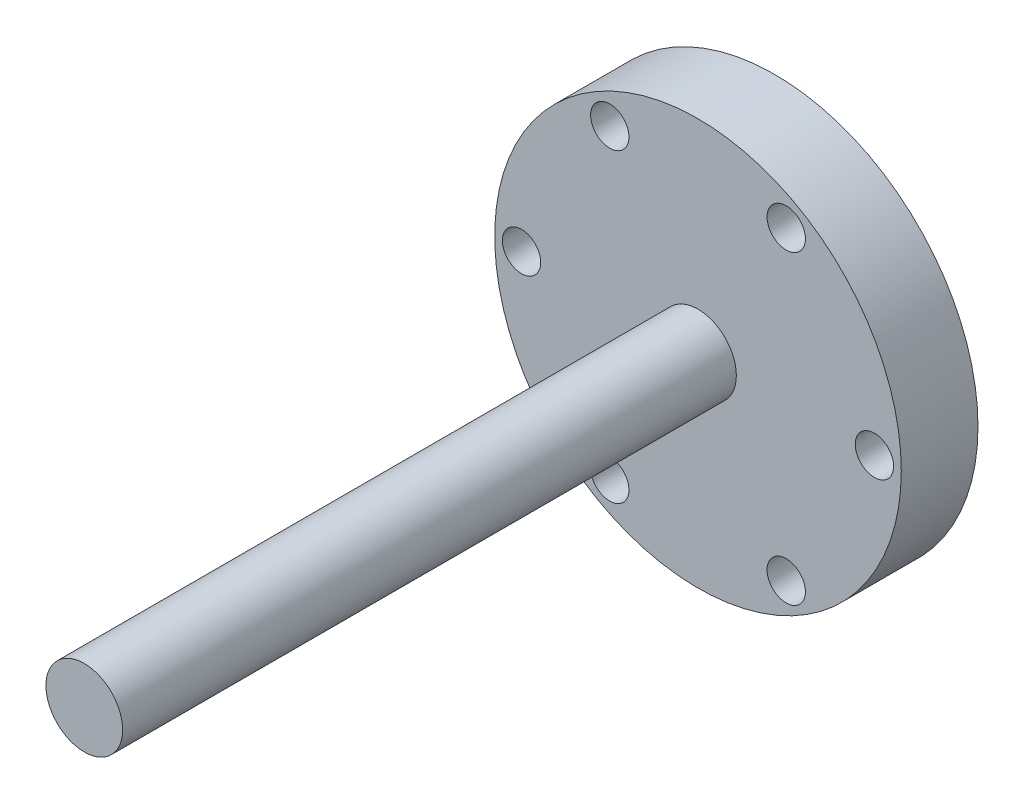
ISO-10303-21;
HEADER;
FILE_DESCRIPTION(('STEP AP214'),'2;1');
FILE_NAME('part.step','',(''),(''),'','','');
FILE_SCHEMA(('AUTOMOTIVE_DESIGN { 1 0 10303 214 1 1 1 1 }'));
ENDSEC;
DATA;
#1=APPLICATION_CONTEXT('core data for automotive mechanical design processes');
#2=APPLICATION_PROTOCOL_DEFINITION('international standard','automotive_design',2000,#1);
#3=PRODUCT_CONTEXT('',#1,'mechanical');
#4=PRODUCT('Part','Part','',(#3));
#5=PRODUCT_RELATED_PRODUCT_CATEGORY('part','',(#4));
#6=PRODUCT_DEFINITION_FORMATION('','',#4);
#7=PRODUCT_DEFINITION_CONTEXT('part definition',#1,'design');
#8=PRODUCT_DEFINITION('design','',#6,#7);
#9=PRODUCT_DEFINITION_SHAPE('','',#8);
#10=(LENGTH_UNIT() NAMED_UNIT(*) SI_UNIT(.MILLI.,.METRE.));
#11=(NAMED_UNIT(*) PLANE_ANGLE_UNIT() SI_UNIT($,.RADIAN.));
#12=(NAMED_UNIT(*) SI_UNIT($,.STERADIAN.) SOLID_ANGLE_UNIT());
#13=UNCERTAINTY_MEASURE_WITH_UNIT(LENGTH_MEASURE(1.E-05),#10,'distance_accuracy_value','');
#14=(GEOMETRIC_REPRESENTATION_CONTEXT(3) GLOBAL_UNCERTAINTY_ASSIGNED_CONTEXT((#13)) GLOBAL_UNIT_ASSIGNED_CONTEXT((#10,
#11,#12)) REPRESENTATION_CONTEXT('',''));
#15=CARTESIAN_POINT('',(0.,0.,0.));
#16=DIRECTION('',(0.,0.,1.));
#17=DIRECTION('',(1.,0.,0.));
#18=AXIS2_PLACEMENT_3D('',#15,#16,#17);
#19=CARTESIAN_POINT('',(0.,0.,10.));
#20=DIRECTION('',(0.,0.,1.));
#21=DIRECTION('',(1.,0.,0.));
#22=AXIS2_PLACEMENT_3D('',#19,#20,#21);
#23=PLANE('',#22);
#24=CARTESIAN_POINT('',(0.,0.,10.));
#25=DIRECTION('',(0.,0.,1.));
#26=DIRECTION('',(1.,0.,0.));
#27=AXIS2_PLACEMENT_3D('',#24,#25,#26);
#28=CIRCLE('',#27,5.);
#29=CARTESIAN_POINT('',(5.,0.,10.));
#30=VERTEX_POINT('',#29);
#31=EDGE_CURVE('E80',#30,#30,#28,.T.);
#32=ORIENTED_EDGE('',*,*,#31,.F.);
#33=EDGE_LOOP('',(#32));
#34=FACE_BOUND('',#33,.T.);
#35=CARTESIAN_POINT('',(-11.5000000000001,-19.918584287042,10.));
#36=DIRECTION('',(0.,0.,1.));
#37=DIRECTION('',(1.,0.,0.));
#38=AXIS2_PLACEMENT_3D('',#35,#36,#37);
#39=CIRCLE('',#38,2.5);
#40=CARTESIAN_POINT('',(-9.00000000000009,-19.918584287042,10.));
#41=VERTEX_POINT('',#40);
#42=EDGE_CURVE('E65',#41,#41,#39,.T.);
#43=ORIENTED_EDGE('',*,*,#42,.F.);
#44=EDGE_LOOP('',(#43));
#45=FACE_BOUND('',#44,.T.);
#46=CARTESIAN_POINT('',(-11.5000000000001,19.918584287042,10.));
#47=DIRECTION('',(0.,0.,1.));
#48=DIRECTION('',(1.,0.,0.));
#49=AXIS2_PLACEMENT_3D('',#46,#47,#48);
#50=CIRCLE('',#49,2.5);
#51=CARTESIAN_POINT('',(-9.0000000000001,19.918584287042,10.));
#52=VERTEX_POINT('',#51);
#53=EDGE_CURVE('E53',#52,#52,#50,.T.);
#54=ORIENTED_EDGE('',*,*,#53,.F.);
#55=EDGE_LOOP('',(#54));
#56=FACE_BOUND('',#55,.T.);
#57=CARTESIAN_POINT('',(23.,0.,10.));
#58=DIRECTION('',(0.,0.,1.));
#59=DIRECTION('',(1.,0.,0.));
#60=AXIS2_PLACEMENT_3D('',#57,#58,#59);
#61=CIRCLE('',#60,2.5);
#62=CARTESIAN_POINT('',(25.5,0.,10.));
#63=VERTEX_POINT('',#62);
#64=EDGE_CURVE('E42',#63,#63,#61,.T.);
#65=ORIENTED_EDGE('',*,*,#64,.F.);
#66=EDGE_LOOP('',(#65));
#67=FACE_BOUND('',#66,.T.);
#68=CARTESIAN_POINT('',(0.,0.,10.));
#69=DIRECTION('',(0.,0.,1.));
#70=DIRECTION('',(1.,0.,0.));
#71=AXIS2_PLACEMENT_3D('',#68,#69,#70);
#72=CIRCLE('',#71,26.5);
#73=CARTESIAN_POINT('',(26.5,0.,10.));
#74=VERTEX_POINT('',#73);
#75=EDGE_CURVE('E10',#74,#74,#72,.T.);
#76=ORIENTED_EDGE('',*,*,#75,.T.);
#77=EDGE_LOOP('',(#76));
#78=FACE_BOUND('',#77,.T.);
#79=CARTESIAN_POINT('',(11.5,19.9185842870421,10.));
#80=DIRECTION('',(0.,0.,1.));
#81=DIRECTION('',(1.,0.,0.));
#82=AXIS2_PLACEMENT_3D('',#79,#80,#81);
#83=CIRCLE('',#82,2.5);
#84=CARTESIAN_POINT('',(14.,19.9185842870421,10.));
#85=VERTEX_POINT('',#84);
#86=EDGE_CURVE('E47',#85,#85,#83,.T.);
#87=ORIENTED_EDGE('',*,*,#86,.F.);
#88=EDGE_LOOP('',(#87));
#89=FACE_BOUND('',#88,.T.);
#90=CARTESIAN_POINT('',(-23.,1.60608141586784E-13,10.));
#91=DIRECTION('',(0.,0.,1.));
#92=DIRECTION('',(1.,0.,0.));
#93=AXIS2_PLACEMENT_3D('',#90,#91,#92);
#94=CIRCLE('',#93,2.5);
#95=CARTESIAN_POINT('',(-20.5,1.60608141586784E-13,10.));
#96=VERTEX_POINT('',#95);
#97=EDGE_CURVE('E59',#96,#96,#94,.T.);
#98=ORIENTED_EDGE('',*,*,#97,.F.);
#99=EDGE_LOOP('',(#98));
#100=FACE_BOUND('',#99,.T.);
#101=CARTESIAN_POINT('',(11.5,-19.9185842870421,10.));
#102=DIRECTION('',(0.,0.,1.));
#103=DIRECTION('',(1.,0.,0.));
#104=AXIS2_PLACEMENT_3D('',#101,#102,#103);
#105=CIRCLE('',#104,2.5);
#106=CARTESIAN_POINT('',(14.,-19.9185842870421,10.));
#107=VERTEX_POINT('',#106);
#108=EDGE_CURVE('E71',#107,#107,#105,.T.);
#109=ORIENTED_EDGE('',*,*,#108,.F.);
#110=EDGE_LOOP('',(#109));
#111=FACE_BOUND('',#110,.T.);
#112=ADVANCED_FACE('F31',(#34,#45,#56,#67,#78,#89,#100,#111),#23,.T.);
#113=CARTESIAN_POINT('',(0.,0.,0.));
#114=DIRECTION('',(0.,0.,1.));
#115=DIRECTION('',(1.,0.,0.));
#116=AXIS2_PLACEMENT_3D('',#113,#114,#115);
#117=PLANE('',#116);
#118=CARTESIAN_POINT('',(0.,0.,0.));
#119=DIRECTION('',(0.,0.,1.));
#120=DIRECTION('',(1.,0.,0.));
#121=AXIS2_PLACEMENT_3D('',#118,#119,#120);
#122=CIRCLE('',#121,26.5);
#123=CARTESIAN_POINT('',(26.5,0.,0.));
#124=VERTEX_POINT('',#123);
#125=EDGE_CURVE('E35',#124,#124,#122,.T.);
#126=ORIENTED_EDGE('',*,*,#125,.F.);
#127=EDGE_LOOP('',(#126));
#128=FACE_BOUND('',#127,.T.);
#129=CARTESIAN_POINT('',(23.,0.,0.));
#130=DIRECTION('',(0.,0.,1.));
#131=DIRECTION('',(1.,0.,0.));
#132=AXIS2_PLACEMENT_3D('',#129,#130,#131);
#133=CIRCLE('',#132,2.5);
#134=CARTESIAN_POINT('',(25.5,0.,0.));
#135=VERTEX_POINT('',#134);
#136=EDGE_CURVE('E44',#135,#135,#133,.T.);
#137=ORIENTED_EDGE('',*,*,#136,.T.);
#138=EDGE_LOOP('',(#137));
#139=FACE_BOUND('',#138,.T.);
#140=CARTESIAN_POINT('',(11.5,19.9185842870421,0.));
#141=DIRECTION('',(0.,0.,1.));
#142=DIRECTION('',(1.,0.,0.));
#143=AXIS2_PLACEMENT_3D('',#140,#141,#142);
#144=CIRCLE('',#143,2.5);
#145=CARTESIAN_POINT('',(14.,19.9185842870421,0.));
#146=VERTEX_POINT('',#145);
#147=EDGE_CURVE('E50',#146,#146,#144,.T.);
#148=ORIENTED_EDGE('',*,*,#147,.T.);
#149=EDGE_LOOP('',(#148));
#150=FACE_BOUND('',#149,.T.);
#151=CARTESIAN_POINT('',(-11.5000000000001,19.918584287042,0.));
#152=DIRECTION('',(0.,0.,1.));
#153=DIRECTION('',(1.,0.,0.));
#154=AXIS2_PLACEMENT_3D('',#151,#152,#153);
#155=CIRCLE('',#154,2.5);
#156=CARTESIAN_POINT('',(-9.0000000000001,19.918584287042,0.));
#157=VERTEX_POINT('',#156);
#158=EDGE_CURVE('E56',#157,#157,#155,.T.);
#159=ORIENTED_EDGE('',*,*,#158,.T.);
#160=EDGE_LOOP('',(#159));
#161=FACE_BOUND('',#160,.T.);
#162=CARTESIAN_POINT('',(-23.,1.60608141586784E-13,0.));
#163=DIRECTION('',(0.,0.,1.));
#164=DIRECTION('',(1.,0.,0.));
#165=AXIS2_PLACEMENT_3D('',#162,#163,#164);
#166=CIRCLE('',#165,2.5);
#167=CARTESIAN_POINT('',(-20.5,1.60608141586784E-13,0.));
#168=VERTEX_POINT('',#167);
#169=EDGE_CURVE('E62',#168,#168,#166,.T.);
#170=ORIENTED_EDGE('',*,*,#169,.T.);
#171=EDGE_LOOP('',(#170));
#172=FACE_BOUND('',#171,.T.);
#173=CARTESIAN_POINT('',(-11.5000000000001,-19.918584287042,0.));
#174=DIRECTION('',(0.,0.,1.));
#175=DIRECTION('',(1.,0.,0.));
#176=AXIS2_PLACEMENT_3D('',#173,#174,#175);
#177=CIRCLE('',#176,2.5);
#178=CARTESIAN_POINT('',(-9.00000000000009,-19.918584287042,0.));
#179=VERTEX_POINT('',#178);
#180=EDGE_CURVE('E68',#179,#179,#177,.T.);
#181=ORIENTED_EDGE('',*,*,#180,.T.);
#182=EDGE_LOOP('',(#181));
#183=FACE_BOUND('',#182,.T.);
#184=CARTESIAN_POINT('',(11.5,-19.9185842870421,0.));
#185=DIRECTION('',(0.,0.,1.));
#186=DIRECTION('',(1.,0.,0.));
#187=AXIS2_PLACEMENT_3D('',#184,#185,#186);
#188=CIRCLE('',#187,2.5);
#189=CARTESIAN_POINT('',(14.,-19.9185842870421,0.));
#190=VERTEX_POINT('',#189);
#191=EDGE_CURVE('E74',#190,#190,#188,.T.);
#192=ORIENTED_EDGE('',*,*,#191,.T.);
#193=EDGE_LOOP('',(#192));
#194=FACE_BOUND('',#193,.T.);
#195=ADVANCED_FACE('F97',(#128,#139,#150,#161,#172,#183,#194),#117,.F.);
#196=CARTESIAN_POINT('',(0.,0.,10.));
#197=DIRECTION('',(0.,0.,-1.));
#198=DIRECTION('',(-1.,0.,0.));
#199=AXIS2_PLACEMENT_3D('',#196,#197,#198);
#200=CYLINDRICAL_SURFACE('',#199,26.5);
#201=ORIENTED_EDGE('',*,*,#75,.F.);
#202=EDGE_LOOP('',(#201));
#203=FACE_BOUND('',#202,.T.);
#204=ORIENTED_EDGE('',*,*,#125,.T.);
#205=EDGE_LOOP('',(#204));
#206=FACE_BOUND('',#205,.T.);
#207=ADVANCED_FACE('F33',(#203,#206),#200,.T.);
#208=CARTESIAN_POINT('',(23.,0.,10.));
#209=DIRECTION('',(0.,0.,-1.));
#210=DIRECTION('',(-1.,0.,0.));
#211=AXIS2_PLACEMENT_3D('',#208,#209,#210);
#212=CYLINDRICAL_SURFACE('',#211,2.5);
#213=ORIENTED_EDGE('',*,*,#64,.T.);
#214=EDGE_LOOP('',(#213));
#215=FACE_BOUND('',#214,.T.);
#216=ORIENTED_EDGE('',*,*,#136,.F.);
#217=EDGE_LOOP('',(#216));
#218=FACE_BOUND('',#217,.T.);
#219=ADVANCED_FACE('F122',(#215,#218),#212,.F.);
#220=CARTESIAN_POINT('',(11.5,19.9185842870421,10.));
#221=DIRECTION('',(0.,0.,-1.));
#222=DIRECTION('',(-1.,0.,0.));
#223=AXIS2_PLACEMENT_3D('',#220,#221,#222);
#224=CYLINDRICAL_SURFACE('',#223,2.5);
#225=ORIENTED_EDGE('',*,*,#86,.T.);
#226=EDGE_LOOP('',(#225));
#227=FACE_BOUND('',#226,.T.);
#228=ORIENTED_EDGE('',*,*,#147,.F.);
#229=EDGE_LOOP('',(#228));
#230=FACE_BOUND('',#229,.T.);
#231=ADVANCED_FACE('F129',(#227,#230),#224,.F.);
#232=CARTESIAN_POINT('',(-11.5000000000001,19.918584287042,10.));
#233=DIRECTION('',(0.,0.,-1.));
#234=DIRECTION('',(-1.,0.,0.));
#235=AXIS2_PLACEMENT_3D('',#232,#233,#234);
#236=CYLINDRICAL_SURFACE('',#235,2.5);
#237=ORIENTED_EDGE('',*,*,#53,.T.);
#238=EDGE_LOOP('',(#237));
#239=FACE_BOUND('',#238,.T.);
#240=ORIENTED_EDGE('',*,*,#158,.F.);
#241=EDGE_LOOP('',(#240));
#242=FACE_BOUND('',#241,.T.);
#243=ADVANCED_FACE('F133',(#239,#242),#236,.F.);
#244=CARTESIAN_POINT('',(-23.,1.60608141586784E-13,10.));
#245=DIRECTION('',(0.,0.,-1.));
#246=DIRECTION('',(-1.,0.,0.));
#247=AXIS2_PLACEMENT_3D('',#244,#245,#246);
#248=CYLINDRICAL_SURFACE('',#247,2.5);
#249=ORIENTED_EDGE('',*,*,#97,.T.);
#250=EDGE_LOOP('',(#249));
#251=FACE_BOUND('',#250,.T.);
#252=ORIENTED_EDGE('',*,*,#169,.F.);
#253=EDGE_LOOP('',(#252));
#254=FACE_BOUND('',#253,.T.);
#255=ADVANCED_FACE('F137',(#251,#254),#248,.F.);
#256=CARTESIAN_POINT('',(-11.5000000000001,-19.918584287042,10.));
#257=DIRECTION('',(0.,0.,-1.));
#258=DIRECTION('',(-1.,0.,0.));
#259=AXIS2_PLACEMENT_3D('',#256,#257,#258);
#260=CYLINDRICAL_SURFACE('',#259,2.5);
#261=ORIENTED_EDGE('',*,*,#42,.T.);
#262=EDGE_LOOP('',(#261));
#263=FACE_BOUND('',#262,.T.);
#264=ORIENTED_EDGE('',*,*,#180,.F.);
#265=EDGE_LOOP('',(#264));
#266=FACE_BOUND('',#265,.T.);
#267=ADVANCED_FACE('F113',(#263,#266),#260,.F.);
#268=CARTESIAN_POINT('',(11.5,-19.9185842870421,10.));
#269=DIRECTION('',(0.,0.,-1.));
#270=DIRECTION('',(-1.,0.,0.));
#271=AXIS2_PLACEMENT_3D('',#268,#269,#270);
#272=CYLINDRICAL_SURFACE('',#271,2.5);
#273=ORIENTED_EDGE('',*,*,#108,.T.);
#274=EDGE_LOOP('',(#273));
#275=FACE_BOUND('',#274,.T.);
#276=ORIENTED_EDGE('',*,*,#191,.F.);
#277=EDGE_LOOP('',(#276));
#278=FACE_BOUND('',#277,.T.);
#279=ADVANCED_FACE('F91',(#275,#278),#272,.F.);
#280=CARTESIAN_POINT('',(0.,0.,90.));
#281=DIRECTION('',(0.,0.,-1.));
#282=DIRECTION('',(-1.,0.,0.));
#283=AXIS2_PLACEMENT_3D('',#280,#281,#282);
#284=CYLINDRICAL_SURFACE('',#283,5.);
#285=CARTESIAN_POINT('',(0.,0.,90.));
#286=DIRECTION('',(0.,0.,1.));
#287=DIRECTION('',(1.,0.,0.));
#288=AXIS2_PLACEMENT_3D('',#285,#286,#287);
#289=CIRCLE('',#288,5.);
#290=CARTESIAN_POINT('',(5.,0.,90.));
#291=VERTEX_POINT('',#290);
#292=EDGE_CURVE('E77',#291,#291,#289,.T.);
#293=ORIENTED_EDGE('',*,*,#292,.F.);
#294=EDGE_LOOP('',(#293));
#295=FACE_BOUND('',#294,.T.);
#296=ORIENTED_EDGE('',*,*,#31,.T.);
#297=EDGE_LOOP('',(#296));
#298=FACE_BOUND('',#297,.T.);
#299=ADVANCED_FACE('F88',(#295,#298),#284,.T.);
#300=CARTESIAN_POINT('',(0.,0.,90.));
#301=DIRECTION('',(0.,0.,1.));
#302=DIRECTION('',(1.,0.,0.));
#303=AXIS2_PLACEMENT_3D('',#300,#301,#302);
#304=PLANE('',#303);
#305=ORIENTED_EDGE('',*,*,#292,.T.);
#306=EDGE_LOOP('',(#305));
#307=FACE_BOUND('',#306,.T.);
#308=ADVANCED_FACE('F86',(#307),#304,.T.);
#309=CLOSED_SHELL('',(#112,#195,#207,#219,#231,#243,#255,#267,#279,#299,#308));
#310=MANIFOLD_SOLID_BREP('B2',#309);
#311=ADVANCED_BREP_SHAPE_REPRESENTATION('',(#18,#310),#14);
#312=SHAPE_DEFINITION_REPRESENTATION(#9,#311);
ENDSEC;
END-ISO-10303-21;
